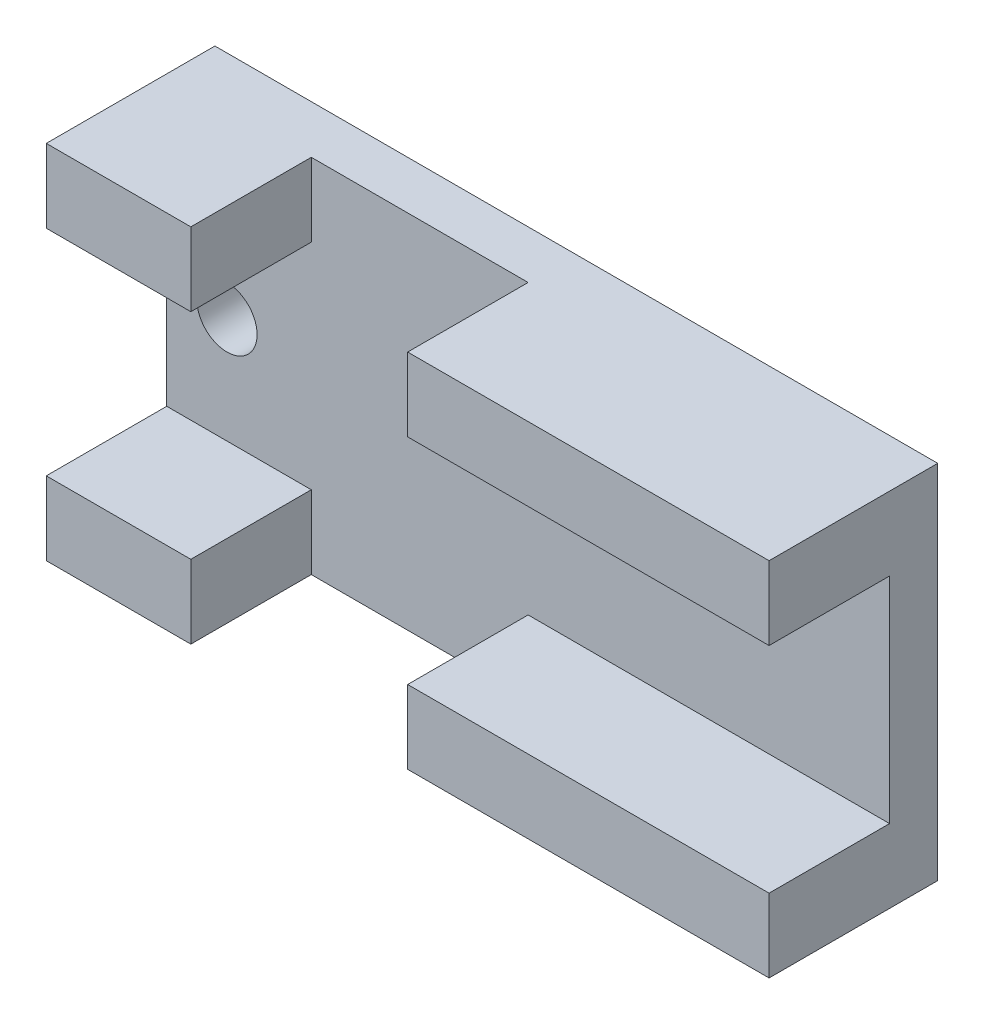
ISO-10303-21;
HEADER;
FILE_DESCRIPTION(('STEP AP214'),'2;1');
FILE_NAME('part.step','',(''),(''),'','','');
FILE_SCHEMA(('AUTOMOTIVE_DESIGN { 1 0 10303 214 1 1 1 1 }'));
ENDSEC;
DATA;
#1=APPLICATION_CONTEXT('core data for automotive mechanical design processes');
#2=APPLICATION_PROTOCOL_DEFINITION('international standard','automotive_design',2000,#1);
#3=PRODUCT_CONTEXT('',#1,'mechanical');
#4=PRODUCT('Part','Part','',(#3));
#5=PRODUCT_RELATED_PRODUCT_CATEGORY('part','',(#4));
#6=PRODUCT_DEFINITION_FORMATION('','',#4);
#7=PRODUCT_DEFINITION_CONTEXT('part definition',#1,'design');
#8=PRODUCT_DEFINITION('design','',#6,#7);
#9=PRODUCT_DEFINITION_SHAPE('','',#8);
#10=(LENGTH_UNIT() NAMED_UNIT(*) SI_UNIT(.MILLI.,.METRE.));
#11=(NAMED_UNIT(*) PLANE_ANGLE_UNIT() SI_UNIT($,.RADIAN.));
#12=(NAMED_UNIT(*) SI_UNIT($,.STERADIAN.) SOLID_ANGLE_UNIT());
#13=UNCERTAINTY_MEASURE_WITH_UNIT(LENGTH_MEASURE(1.E-05),#10,'distance_accuracy_value','');
#14=(GEOMETRIC_REPRESENTATION_CONTEXT(3) GLOBAL_UNCERTAINTY_ASSIGNED_CONTEXT((#13)) GLOBAL_UNIT_ASSIGNED_CONTEXT((#10,
#11,#12)) REPRESENTATION_CONTEXT('',''));
#15=CARTESIAN_POINT('',(0.,0.,0.));
#16=DIRECTION('',(0.,0.,1.));
#17=DIRECTION('',(1.,0.,0.));
#18=AXIS2_PLACEMENT_3D('',#15,#16,#17);
#19=CARTESIAN_POINT('',(0.,0.,5.08));
#20=DIRECTION('',(0.,0.,-1.));
#21=DIRECTION('',(-1.,0.,0.));
#22=AXIS2_PLACEMENT_3D('',#19,#20,#21);
#23=PLANE('',#22);
#24=CARTESIAN_POINT('',(-31.75,0.,5.08));
#25=DIRECTION('',(0.,0.,1.));
#26=DIRECTION('',(1.,0.,0.));
#27=AXIS2_PLACEMENT_3D('',#24,#25,#26);
#28=CIRCLE('',#27,3.175);
#29=CARTESIAN_POINT('',(-28.575,0.,5.08));
#30=VERTEX_POINT('',#29);
#31=EDGE_CURVE('E449',#30,#30,#28,.T.);
#32=ORIENTED_EDGE('',*,*,#31,.F.);
#33=EDGE_LOOP('',(#32));
#34=FACE_BOUND('',#33,.T.);
#35=CARTESIAN_POINT('',(25.4,6.35,5.08));
#36=DIRECTION('',(0.,0.,1.));
#37=DIRECTION('',(1.,0.,0.));
#38=AXIS2_PLACEMENT_3D('',#35,#36,#37);
#39=CIRCLE('',#38,3.175);
#40=CARTESIAN_POINT('',(28.575,6.35,5.08));
#41=VERTEX_POINT('',#40);
#42=EDGE_CURVE('E186',#41,#41,#39,.T.);
#43=ORIENTED_EDGE('',*,*,#42,.F.);
#44=EDGE_LOOP('',(#43));
#45=FACE_BOUND('',#44,.T.);
#46=DIRECTION('',(1.,0.,0.));
#47=VECTOR('',#46,1.);
#48=CARTESIAN_POINT('',(-38.1,11.303,5.08));
#49=LINE('',#48,#47);
#50=CARTESIAN_POINT('',(-38.1,11.303,5.08));
#51=VERTEX_POINT('',#50);
#52=CARTESIAN_POINT('',(-22.86,11.303,5.08));
#53=VERTEX_POINT('',#52);
#54=EDGE_CURVE('E167',#51,#53,#49,.T.);
#55=ORIENTED_EDGE('',*,*,#54,.F.);
#56=DIRECTION('',(0.,-1.,0.));
#57=VECTOR('',#56,1.);
#58=CARTESIAN_POINT('',(-38.1,-19.05,5.08));
#59=LINE('',#58,#57);
#60=CARTESIAN_POINT('',(-38.1,-11.303,5.08));
#61=VERTEX_POINT('',#60);
#62=EDGE_CURVE('E155',#51,#61,#59,.T.);
#63=ORIENTED_EDGE('',*,*,#62,.T.);
#64=DIRECTION('',(-1.,0.,0.));
#65=VECTOR('',#64,1.);
#66=CARTESIAN_POINT('',(-38.1,-11.303,5.08));
#67=LINE('',#66,#65);
#68=CARTESIAN_POINT('',(-22.86,-11.303,5.08));
#69=VERTEX_POINT('',#68);
#70=EDGE_CURVE('E217',#69,#61,#67,.T.);
#71=ORIENTED_EDGE('',*,*,#70,.F.);
#72=DIRECTION('',(0.,1.,0.));
#73=VECTOR('',#72,1.);
#74=CARTESIAN_POINT('',(-22.86,-19.05,5.08));
#75=LINE('',#74,#73);
#76=CARTESIAN_POINT('',(-22.86,-19.05,5.08));
#77=VERTEX_POINT('',#76);
#78=EDGE_CURVE('E220',#77,#69,#75,.T.);
#79=ORIENTED_EDGE('',*,*,#78,.F.);
#80=DIRECTION('',(1.,0.,0.));
#81=VECTOR('',#80,1.);
#82=CARTESIAN_POINT('',(-38.1,-19.05,5.08));
#83=LINE('',#82,#81);
#84=CARTESIAN_POINT('',(0.,-19.05,5.08));
#85=VERTEX_POINT('',#84);
#86=EDGE_CURVE('E165',#77,#85,#83,.T.);
#87=ORIENTED_EDGE('',*,*,#86,.T.);
#88=DIRECTION('',(0.,-1.,0.));
#89=VECTOR('',#88,1.);
#90=CARTESIAN_POINT('',(0.,-19.05,5.08));
#91=LINE('',#90,#89);
#92=CARTESIAN_POINT('',(0.,-11.303,5.08));
#93=VERTEX_POINT('',#92);
#94=EDGE_CURVE('E253',#93,#85,#91,.T.);
#95=ORIENTED_EDGE('',*,*,#94,.F.);
#96=DIRECTION('',(-1.,0.,0.));
#97=VECTOR('',#96,1.);
#98=CARTESIAN_POINT('',(0.,-11.303,5.08));
#99=LINE('',#98,#97);
#100=CARTESIAN_POINT('',(38.1,-11.303,5.08));
#101=VERTEX_POINT('',#100);
#102=EDGE_CURVE('E249',#101,#93,#99,.T.);
#103=ORIENTED_EDGE('',*,*,#102,.F.);
#104=DIRECTION('',(0.,1.,0.));
#105=VECTOR('',#104,1.);
#106=CARTESIAN_POINT('',(38.1,-19.05,5.08));
#107=LINE('',#106,#105);
#108=CARTESIAN_POINT('',(38.1,11.303,5.08));
#109=VERTEX_POINT('',#108);
#110=EDGE_CURVE('E305',#101,#109,#107,.T.);
#111=ORIENTED_EDGE('',*,*,#110,.T.);
#112=DIRECTION('',(1.,0.,0.));
#113=VECTOR('',#112,1.);
#114=CARTESIAN_POINT('',(0.,11.303,5.08));
#115=LINE('',#114,#113);
#116=CARTESIAN_POINT('',(0.,11.303,5.08));
#117=VERTEX_POINT('',#116);
#118=EDGE_CURVE('E276',#117,#109,#115,.T.);
#119=ORIENTED_EDGE('',*,*,#118,.F.);
#120=DIRECTION('',(0.,-1.,0.));
#121=VECTOR('',#120,1.);
#122=CARTESIAN_POINT('',(0.,19.05,5.08));
#123=LINE('',#122,#121);
#124=CARTESIAN_POINT('',(0.,19.05,5.08));
#125=VERTEX_POINT('',#124);
#126=EDGE_CURVE('E258',#125,#117,#123,.T.);
#127=ORIENTED_EDGE('',*,*,#126,.F.);
#128=DIRECTION('',(-1.,0.,0.));
#129=VECTOR('',#128,1.);
#130=CARTESIAN_POINT('',(-38.1,19.05,5.08));
#131=LINE('',#130,#129);
#132=CARTESIAN_POINT('',(-22.86,19.05,5.08));
#133=VERTEX_POINT('',#132);
#134=EDGE_CURVE('E63',#125,#133,#131,.T.);
#135=ORIENTED_EDGE('',*,*,#134,.T.);
#136=DIRECTION('',(0.,1.,0.));
#137=VECTOR('',#136,1.);
#138=CARTESIAN_POINT('',(-22.86,19.05,5.08));
#139=LINE('',#138,#137);
#140=EDGE_CURVE('E58',#53,#133,#139,.T.);
#141=ORIENTED_EDGE('',*,*,#140,.F.);
#142=EDGE_LOOP('',(#55,#63,#71,#79,#87,#95,#103,#111,#119,#127,#135,#141));
#143=FACE_BOUND('',#142,.T.);
#144=ADVANCED_FACE('F42',(#34,#45,#143),#23,.F.);
#145=CARTESIAN_POINT('',(38.1,-19.05,5.08));
#146=DIRECTION('',(-1.,0.,0.));
#147=DIRECTION('',(0.,0.,1.));
#148=AXIS2_PLACEMENT_3D('',#145,#146,#147);
#149=PLANE('',#148);
#150=DIRECTION('',(0.,1.,0.));
#151=VECTOR('',#150,1.);
#152=CARTESIAN_POINT('',(38.1,-19.05,0.));
#153=LINE('',#152,#151);
#154=CARTESIAN_POINT('',(38.1,-19.05,0.));
#155=VERTEX_POINT('',#154);
#156=CARTESIAN_POINT('',(38.1,19.05,0.));
#157=VERTEX_POINT('',#156);
#158=EDGE_CURVE('E304',#155,#157,#153,.T.);
#159=ORIENTED_EDGE('',*,*,#158,.T.);
#160=DIRECTION('',(0.,0.,-1.));
#161=VECTOR('',#160,1.);
#162=CARTESIAN_POINT('',(38.1,19.05,5.08));
#163=LINE('',#162,#161);
#164=CARTESIAN_POINT('',(38.1,19.05,17.78));
#165=VERTEX_POINT('',#164);
#166=EDGE_CURVE('E11',#165,#157,#163,.T.);
#167=ORIENTED_EDGE('',*,*,#166,.F.);
#168=DIRECTION('',(0.,1.,0.));
#169=VECTOR('',#168,1.);
#170=CARTESIAN_POINT('',(38.1,19.05,17.78));
#171=LINE('',#170,#169);
#172=CARTESIAN_POINT('',(38.1,11.303,17.78));
#173=VERTEX_POINT('',#172);
#174=EDGE_CURVE('E279',#173,#165,#171,.T.);
#175=ORIENTED_EDGE('',*,*,#174,.F.);
#176=DIRECTION('',(0.,0.,-1.));
#177=VECTOR('',#176,1.);
#178=CARTESIAN_POINT('',(38.1,11.303,17.78));
#179=LINE('',#178,#177);
#180=EDGE_CURVE('E296',#173,#109,#179,.T.);
#181=ORIENTED_EDGE('',*,*,#180,.T.);
#182=ORIENTED_EDGE('',*,*,#110,.F.);
#183=DIRECTION('',(0.,0.,-1.));
#184=VECTOR('',#183,1.);
#185=CARTESIAN_POINT('',(38.1,-11.303,17.78));
#186=LINE('',#185,#184);
#187=CARTESIAN_POINT('',(38.1,-11.303,17.78));
#188=VERTEX_POINT('',#187);
#189=EDGE_CURVE('E240',#188,#101,#186,.T.);
#190=ORIENTED_EDGE('',*,*,#189,.F.);
#191=DIRECTION('',(0.,1.,0.));
#192=VECTOR('',#191,1.);
#193=CARTESIAN_POINT('',(38.1,-19.05,17.78));
#194=LINE('',#193,#192);
#195=CARTESIAN_POINT('',(38.1,-19.05,17.78));
#196=VERTEX_POINT('',#195);
#197=EDGE_CURVE('E261',#196,#188,#194,.T.);
#198=ORIENTED_EDGE('',*,*,#197,.F.);
#199=DIRECTION('',(0.,0.,-1.));
#200=VECTOR('',#199,1.);
#201=CARTESIAN_POINT('',(38.1,-19.05,5.08));
#202=LINE('',#201,#200);
#203=EDGE_CURVE('E313',#196,#155,#202,.T.);
#204=ORIENTED_EDGE('',*,*,#203,.T.);
#205=EDGE_LOOP('',(#159,#167,#175,#181,#182,#190,#198,#204));
#206=FACE_BOUND('',#205,.T.);
#207=ADVANCED_FACE('F44',(#206),#149,.F.);
#208=CARTESIAN_POINT('',(-38.1,19.05,5.08));
#209=DIRECTION('',(0.,-1.,0.));
#210=DIRECTION('',(0.,0.,-1.));
#211=AXIS2_PLACEMENT_3D('',#208,#209,#210);
#212=PLANE('',#211);
#213=DIRECTION('',(-1.,0.,0.));
#214=VECTOR('',#213,1.);
#215=CARTESIAN_POINT('',(-38.1,19.05,0.));
#216=LINE('',#215,#214);
#217=CARTESIAN_POINT('',(-38.1,19.05,0.));
#218=VERTEX_POINT('',#217);
#219=EDGE_CURVE('E317',#157,#218,#216,.T.);
#220=ORIENTED_EDGE('',*,*,#219,.T.);
#221=DIRECTION('',(0.,0.,-1.));
#222=VECTOR('',#221,1.);
#223=CARTESIAN_POINT('',(-38.1,19.05,5.08));
#224=LINE('',#223,#222);
#225=CARTESIAN_POINT('',(-38.1,19.05,17.78));
#226=VERTEX_POINT('',#225);
#227=EDGE_CURVE('E51',#226,#218,#224,.T.);
#228=ORIENTED_EDGE('',*,*,#227,.F.);
#229=DIRECTION('',(-1.,0.,0.));
#230=VECTOR('',#229,1.);
#231=CARTESIAN_POINT('',(-38.1,19.05,17.78));
#232=LINE('',#231,#230);
#233=CARTESIAN_POINT('',(-22.86,19.05,17.78));
#234=VERTEX_POINT('',#233);
#235=EDGE_CURVE('E193',#234,#226,#232,.T.);
#236=ORIENTED_EDGE('',*,*,#235,.F.);
#237=DIRECTION('',(0.,0.,-1.));
#238=VECTOR('',#237,1.);
#239=CARTESIAN_POINT('',(-22.86,19.05,17.78));
#240=LINE('',#239,#238);
#241=EDGE_CURVE('E183',#234,#133,#240,.T.);
#242=ORIENTED_EDGE('',*,*,#241,.T.);
#243=ORIENTED_EDGE('',*,*,#134,.F.);
#244=DIRECTION('',(0.,0.,-1.));
#245=VECTOR('',#244,1.);
#246=CARTESIAN_POINT('',(0.,19.05,17.78));
#247=LINE('',#246,#245);
#248=CARTESIAN_POINT('',(0.,19.05,17.78));
#249=VERTEX_POINT('',#248);
#250=EDGE_CURVE('E286',#249,#125,#247,.T.);
#251=ORIENTED_EDGE('',*,*,#250,.F.);
#252=DIRECTION('',(-1.,0.,0.));
#253=VECTOR('',#252,1.);
#254=CARTESIAN_POINT('',(0.,19.05,17.78));
#255=LINE('',#254,#253);
#256=EDGE_CURVE('E283',#165,#249,#255,.T.);
#257=ORIENTED_EDGE('',*,*,#256,.F.);
#258=ORIENTED_EDGE('',*,*,#166,.T.);
#259=EDGE_LOOP('',(#220,#228,#236,#242,#243,#251,#257,#258));
#260=FACE_BOUND('',#259,.T.);
#261=ADVANCED_FACE('F377',(#260),#212,.F.);
#262=CARTESIAN_POINT('',(-38.1,-19.05,5.08));
#263=DIRECTION('',(1.,0.,0.));
#264=DIRECTION('',(0.,0.,-1.));
#265=AXIS2_PLACEMENT_3D('',#262,#263,#264);
#266=PLANE('',#265);
#267=DIRECTION('',(0.,-1.,0.));
#268=VECTOR('',#267,1.);
#269=CARTESIAN_POINT('',(-38.1,-19.05,0.));
#270=LINE('',#269,#268);
#271=CARTESIAN_POINT('',(-38.1,-19.05,0.));
#272=VERTEX_POINT('',#271);
#273=EDGE_CURVE('E320',#218,#272,#270,.T.);
#274=ORIENTED_EDGE('',*,*,#273,.T.);
#275=DIRECTION('',(0.,0.,-1.));
#276=VECTOR('',#275,1.);
#277=CARTESIAN_POINT('',(-38.1,-19.05,5.08));
#278=LINE('',#277,#276);
#279=CARTESIAN_POINT('',(-38.1,-19.05,17.78));
#280=VERTEX_POINT('',#279);
#281=EDGE_CURVE('E328',#280,#272,#278,.T.);
#282=ORIENTED_EDGE('',*,*,#281,.F.);
#283=DIRECTION('',(0.,-1.,0.));
#284=VECTOR('',#283,1.);
#285=CARTESIAN_POINT('',(-38.1,-19.05,17.78));
#286=LINE('',#285,#284);
#287=CARTESIAN_POINT('',(-38.1,-11.303,17.78));
#288=VERTEX_POINT('',#287);
#289=EDGE_CURVE('E221',#288,#280,#286,.T.);
#290=ORIENTED_EDGE('',*,*,#289,.F.);
#291=DIRECTION('',(0.,0.,-1.));
#292=VECTOR('',#291,1.);
#293=CARTESIAN_POINT('',(-38.1,-11.303,17.78));
#294=LINE('',#293,#292);
#295=EDGE_CURVE('E162',#288,#61,#294,.T.);
#296=ORIENTED_EDGE('',*,*,#295,.T.);
#297=ORIENTED_EDGE('',*,*,#62,.F.);
#298=DIRECTION('',(0.,0.,-1.));
#299=VECTOR('',#298,1.);
#300=CARTESIAN_POINT('',(-38.1,11.303,17.78));
#301=LINE('',#300,#299);
#302=CARTESIAN_POINT('',(-38.1,11.303,17.78));
#303=VERTEX_POINT('',#302);
#304=EDGE_CURVE('E159',#303,#51,#301,.T.);
#305=ORIENTED_EDGE('',*,*,#304,.F.);
#306=DIRECTION('',(0.,-1.,0.));
#307=VECTOR('',#306,1.);
#308=CARTESIAN_POINT('',(-38.1,19.05,17.78));
#309=LINE('',#308,#307);
#310=EDGE_CURVE('E195',#226,#303,#309,.T.);
#311=ORIENTED_EDGE('',*,*,#310,.F.);
#312=ORIENTED_EDGE('',*,*,#227,.T.);
#313=EDGE_LOOP('',(#274,#282,#290,#296,#297,#305,#311,#312));
#314=FACE_BOUND('',#313,.T.);
#315=ADVANCED_FACE('F156',(#314),#266,.F.);
#316=CARTESIAN_POINT('',(-38.1,-19.05,5.08));
#317=DIRECTION('',(0.,1.,0.));
#318=DIRECTION('',(0.,0.,1.));
#319=AXIS2_PLACEMENT_3D('',#316,#317,#318);
#320=PLANE('',#319);
#321=DIRECTION('',(1.,0.,0.));
#322=VECTOR('',#321,1.);
#323=CARTESIAN_POINT('',(-38.1,-19.05,0.));
#324=LINE('',#323,#322);
#325=EDGE_CURVE('E308',#272,#155,#324,.T.);
#326=ORIENTED_EDGE('',*,*,#325,.T.);
#327=ORIENTED_EDGE('',*,*,#203,.F.);
#328=DIRECTION('',(1.,0.,0.));
#329=VECTOR('',#328,1.);
#330=CARTESIAN_POINT('',(0.,-19.05,17.78));
#331=LINE('',#330,#329);
#332=CARTESIAN_POINT('',(0.,-19.05,17.78));
#333=VERTEX_POINT('',#332);
#334=EDGE_CURVE('E264',#333,#196,#331,.T.);
#335=ORIENTED_EDGE('',*,*,#334,.F.);
#336=DIRECTION('',(0.,0.,-1.));
#337=VECTOR('',#336,1.);
#338=CARTESIAN_POINT('',(0.,-19.05,17.78));
#339=LINE('',#338,#337);
#340=EDGE_CURVE('E225',#333,#85,#339,.T.);
#341=ORIENTED_EDGE('',*,*,#340,.T.);
#342=ORIENTED_EDGE('',*,*,#86,.F.);
#343=DIRECTION('',(0.,0.,-1.));
#344=VECTOR('',#343,1.);
#345=CARTESIAN_POINT('',(-22.86,-19.05,17.78));
#346=LINE('',#345,#344);
#347=CARTESIAN_POINT('',(-22.86,-19.05,17.78));
#348=VERTEX_POINT('',#347);
#349=EDGE_CURVE('E172',#348,#77,#346,.T.);
#350=ORIENTED_EDGE('',*,*,#349,.F.);
#351=DIRECTION('',(1.,0.,0.));
#352=VECTOR('',#351,1.);
#353=CARTESIAN_POINT('',(-38.1,-19.05,17.78));
#354=LINE('',#353,#352);
#355=EDGE_CURVE('E231',#280,#348,#354,.T.);
#356=ORIENTED_EDGE('',*,*,#355,.F.);
#357=ORIENTED_EDGE('',*,*,#281,.T.);
#358=EDGE_LOOP('',(#326,#327,#335,#341,#342,#350,#356,#357));
#359=FACE_BOUND('',#358,.T.);
#360=ADVANCED_FACE('F341',(#359),#320,.F.);
#361=CARTESIAN_POINT('',(0.,0.,0.));
#362=DIRECTION('',(0.,0.,-1.));
#363=DIRECTION('',(-1.,0.,0.));
#364=AXIS2_PLACEMENT_3D('',#361,#362,#363);
#365=PLANE('',#364);
#366=CARTESIAN_POINT('',(-31.75,0.,0.));
#367=DIRECTION('',(0.,0.,1.));
#368=DIRECTION('',(1.,0.,0.));
#369=AXIS2_PLACEMENT_3D('',#366,#367,#368);
#370=CIRCLE('',#369,3.175);
#371=CARTESIAN_POINT('',(-28.575,0.,0.));
#372=VERTEX_POINT('',#371);
#373=EDGE_CURVE('E447',#372,#372,#370,.T.);
#374=ORIENTED_EDGE('',*,*,#373,.T.);
#375=EDGE_LOOP('',(#374));
#376=FACE_BOUND('',#375,.T.);
#377=CARTESIAN_POINT('',(25.4,6.35,0.));
#378=DIRECTION('',(0.,0.,1.));
#379=DIRECTION('',(1.,0.,0.));
#380=AXIS2_PLACEMENT_3D('',#377,#378,#379);
#381=CIRCLE('',#380,3.175);
#382=CARTESIAN_POINT('',(28.575,6.35,0.));
#383=VERTEX_POINT('',#382);
#384=EDGE_CURVE('E179',#383,#383,#381,.T.);
#385=ORIENTED_EDGE('',*,*,#384,.T.);
#386=EDGE_LOOP('',(#385));
#387=FACE_BOUND('',#386,.T.);
#388=ORIENTED_EDGE('',*,*,#158,.F.);
#389=ORIENTED_EDGE('',*,*,#325,.F.);
#390=ORIENTED_EDGE('',*,*,#273,.F.);
#391=ORIENTED_EDGE('',*,*,#219,.F.);
#392=EDGE_LOOP('',(#388,#389,#390,#391));
#393=FACE_BOUND('',#392,.T.);
#394=ADVANCED_FACE('F339',(#376,#387,#393),#365,.T.);
#395=CARTESIAN_POINT('',(0.,19.05,17.78));
#396=DIRECTION('',(1.,0.,0.));
#397=DIRECTION('',(0.,0.,-1.));
#398=AXIS2_PLACEMENT_3D('',#395,#396,#397);
#399=PLANE('',#398);
#400=ORIENTED_EDGE('',*,*,#126,.T.);
#401=DIRECTION('',(0.,0.,-1.));
#402=VECTOR('',#401,1.);
#403=CARTESIAN_POINT('',(0.,11.303,17.78));
#404=LINE('',#403,#402);
#405=CARTESIAN_POINT('',(0.,11.303,17.78));
#406=VERTEX_POINT('',#405);
#407=EDGE_CURVE('E300',#406,#117,#404,.T.);
#408=ORIENTED_EDGE('',*,*,#407,.F.);
#409=DIRECTION('',(0.,-1.,0.));
#410=VECTOR('',#409,1.);
#411=CARTESIAN_POINT('',(0.,19.05,17.78));
#412=LINE('',#411,#410);
#413=EDGE_CURVE('E271',#249,#406,#412,.T.);
#414=ORIENTED_EDGE('',*,*,#413,.F.);
#415=ORIENTED_EDGE('',*,*,#250,.T.);
#416=EDGE_LOOP('',(#400,#408,#414,#415));
#417=FACE_BOUND('',#416,.T.);
#418=ADVANCED_FACE('F382',(#417),#399,.F.);
#419=CARTESIAN_POINT('',(0.,11.303,17.78));
#420=DIRECTION('',(0.,1.,0.));
#421=DIRECTION('',(0.,0.,1.));
#422=AXIS2_PLACEMENT_3D('',#419,#420,#421);
#423=PLANE('',#422);
#424=ORIENTED_EDGE('',*,*,#118,.T.);
#425=ORIENTED_EDGE('',*,*,#180,.F.);
#426=DIRECTION('',(1.,0.,0.));
#427=VECTOR('',#426,1.);
#428=CARTESIAN_POINT('',(0.,11.303,17.78));
#429=LINE('',#428,#427);
#430=EDGE_CURVE('E275',#406,#173,#429,.T.);
#431=ORIENTED_EDGE('',*,*,#430,.F.);
#432=ORIENTED_EDGE('',*,*,#407,.T.);
#433=EDGE_LOOP('',(#424,#425,#431,#432));
#434=FACE_BOUND('',#433,.T.);
#435=ADVANCED_FACE('F400',(#434),#423,.F.);
#436=CARTESIAN_POINT('',(0.,0.,17.78));
#437=DIRECTION('',(0.,0.,1.));
#438=DIRECTION('',(1.,0.,0.));
#439=AXIS2_PLACEMENT_3D('',#436,#437,#438);
#440=PLANE('',#439);
#441=ORIENTED_EDGE('',*,*,#413,.T.);
#442=ORIENTED_EDGE('',*,*,#430,.T.);
#443=ORIENTED_EDGE('',*,*,#174,.T.);
#444=ORIENTED_EDGE('',*,*,#256,.T.);
#445=EDGE_LOOP('',(#441,#442,#443,#444));
#446=FACE_BOUND('',#445,.T.);
#447=ADVANCED_FACE('F367',(#446),#440,.T.);
#448=CARTESIAN_POINT('',(0.,-19.05,17.78));
#449=DIRECTION('',(1.,0.,0.));
#450=DIRECTION('',(0.,0.,-1.));
#451=AXIS2_PLACEMENT_3D('',#448,#449,#450);
#452=PLANE('',#451);
#453=ORIENTED_EDGE('',*,*,#94,.T.);
#454=ORIENTED_EDGE('',*,*,#340,.F.);
#455=DIRECTION('',(0.,-1.,0.));
#456=VECTOR('',#455,1.);
#457=CARTESIAN_POINT('',(0.,-19.05,17.78));
#458=LINE('',#457,#456);
#459=CARTESIAN_POINT('',(0.,-11.303,17.78));
#460=VERTEX_POINT('',#459);
#461=EDGE_CURVE('E254',#460,#333,#458,.T.);
#462=ORIENTED_EDGE('',*,*,#461,.F.);
#463=DIRECTION('',(0.,0.,-1.));
#464=VECTOR('',#463,1.);
#465=CARTESIAN_POINT('',(0.,-11.303,17.78));
#466=LINE('',#465,#464);
#467=EDGE_CURVE('E244',#460,#93,#466,.T.);
#468=ORIENTED_EDGE('',*,*,#467,.T.);
#469=EDGE_LOOP('',(#453,#454,#462,#468));
#470=FACE_BOUND('',#469,.T.);
#471=ADVANCED_FACE('F356',(#470),#452,.F.);
#472=CARTESIAN_POINT('',(0.,-11.303,17.78));
#473=DIRECTION('',(0.,-1.,0.));
#474=DIRECTION('',(0.,0.,-1.));
#475=AXIS2_PLACEMENT_3D('',#472,#473,#474);
#476=PLANE('',#475);
#477=ORIENTED_EDGE('',*,*,#102,.T.);
#478=ORIENTED_EDGE('',*,*,#467,.F.);
#479=DIRECTION('',(-1.,0.,0.));
#480=VECTOR('',#479,1.);
#481=CARTESIAN_POINT('',(0.,-11.303,17.78));
#482=LINE('',#481,#480);
#483=EDGE_CURVE('E248',#188,#460,#482,.T.);
#484=ORIENTED_EDGE('',*,*,#483,.F.);
#485=ORIENTED_EDGE('',*,*,#189,.T.);
#486=EDGE_LOOP('',(#477,#478,#484,#485));
#487=FACE_BOUND('',#486,.T.);
#488=ADVANCED_FACE('F358',(#487),#476,.F.);
#489=CARTESIAN_POINT('',(0.,0.,17.78));
#490=DIRECTION('',(0.,0.,-1.));
#491=DIRECTION('',(-1.,0.,0.));
#492=AXIS2_PLACEMENT_3D('',#489,#490,#491);
#493=PLANE('',#492);
#494=ORIENTED_EDGE('',*,*,#461,.T.);
#495=ORIENTED_EDGE('',*,*,#334,.T.);
#496=ORIENTED_EDGE('',*,*,#197,.T.);
#497=ORIENTED_EDGE('',*,*,#483,.T.);
#498=EDGE_LOOP('',(#494,#495,#496,#497));
#499=FACE_BOUND('',#498,.T.);
#500=ADVANCED_FACE('F349',(#499),#493,.F.);
#501=CARTESIAN_POINT('',(-22.86,-19.05,17.78));
#502=DIRECTION('',(-1.,0.,0.));
#503=DIRECTION('',(0.,0.,1.));
#504=AXIS2_PLACEMENT_3D('',#501,#502,#503);
#505=PLANE('',#504);
#506=ORIENTED_EDGE('',*,*,#78,.T.);
#507=DIRECTION('',(0.,0.,-1.));
#508=VECTOR('',#507,1.);
#509=CARTESIAN_POINT('',(-22.86,-11.303,17.78));
#510=LINE('',#509,#508);
#511=CARTESIAN_POINT('',(-22.86,-11.303,17.78));
#512=VERTEX_POINT('',#511);
#513=EDGE_CURVE('E210',#512,#69,#510,.T.);
#514=ORIENTED_EDGE('',*,*,#513,.F.);
#515=DIRECTION('',(0.,1.,0.));
#516=VECTOR('',#515,1.);
#517=CARTESIAN_POINT('',(-22.86,-19.05,17.78));
#518=LINE('',#517,#516);
#519=EDGE_CURVE('E228',#348,#512,#518,.T.);
#520=ORIENTED_EDGE('',*,*,#519,.F.);
#521=ORIENTED_EDGE('',*,*,#349,.T.);
#522=EDGE_LOOP('',(#506,#514,#520,#521));
#523=FACE_BOUND('',#522,.T.);
#524=ADVANCED_FACE('F365',(#523),#505,.F.);
#525=CARTESIAN_POINT('',(-38.1,-11.303,17.78));
#526=DIRECTION('',(0.,-1.,0.));
#527=DIRECTION('',(0.,0.,-1.));
#528=AXIS2_PLACEMENT_3D('',#525,#526,#527);
#529=PLANE('',#528);
#530=ORIENTED_EDGE('',*,*,#70,.T.);
#531=ORIENTED_EDGE('',*,*,#295,.F.);
#532=DIRECTION('',(-1.,0.,0.));
#533=VECTOR('',#532,1.);
#534=CARTESIAN_POINT('',(-38.1,-11.303,17.78));
#535=LINE('',#534,#533);
#536=EDGE_CURVE('E216',#512,#288,#535,.T.);
#537=ORIENTED_EDGE('',*,*,#536,.F.);
#538=ORIENTED_EDGE('',*,*,#513,.T.);
#539=EDGE_LOOP('',(#530,#531,#537,#538));
#540=FACE_BOUND('',#539,.T.);
#541=ADVANCED_FACE('F423',(#540),#529,.F.);
#542=CARTESIAN_POINT('',(0.,0.,17.78));
#543=DIRECTION('',(0.,0.,-1.));
#544=DIRECTION('',(-1.,0.,0.));
#545=AXIS2_PLACEMENT_3D('',#542,#543,#544);
#546=PLANE('',#545);
#547=ORIENTED_EDGE('',*,*,#289,.T.);
#548=ORIENTED_EDGE('',*,*,#355,.T.);
#549=ORIENTED_EDGE('',*,*,#519,.T.);
#550=ORIENTED_EDGE('',*,*,#536,.T.);
#551=EDGE_LOOP('',(#547,#548,#549,#550));
#552=FACE_BOUND('',#551,.T.);
#553=ADVANCED_FACE('F427',(#552),#546,.F.);
#554=CARTESIAN_POINT('',(-38.1,11.303,17.78));
#555=DIRECTION('',(0.,1.,0.));
#556=DIRECTION('',(0.,0.,1.));
#557=AXIS2_PLACEMENT_3D('',#554,#555,#556);
#558=PLANE('',#557);
#559=ORIENTED_EDGE('',*,*,#54,.T.);
#560=DIRECTION('',(0.,0.,-1.));
#561=VECTOR('',#560,1.);
#562=CARTESIAN_POINT('',(-22.86,11.303,17.78));
#563=LINE('',#562,#561);
#564=CARTESIAN_POINT('',(-22.86,11.303,17.78));
#565=VERTEX_POINT('',#564);
#566=EDGE_CURVE('E178',#565,#53,#563,.T.);
#567=ORIENTED_EDGE('',*,*,#566,.F.);
#568=DIRECTION('',(1.,0.,0.));
#569=VECTOR('',#568,1.);
#570=CARTESIAN_POINT('',(-38.1,11.303,17.78));
#571=LINE('',#570,#569);
#572=EDGE_CURVE('E175',#303,#565,#571,.T.);
#573=ORIENTED_EDGE('',*,*,#572,.F.);
#574=ORIENTED_EDGE('',*,*,#304,.T.);
#575=EDGE_LOOP('',(#559,#567,#573,#574));
#576=FACE_BOUND('',#575,.T.);
#577=ADVANCED_FACE('F174',(#576),#558,.F.);
#578=CARTESIAN_POINT('',(-22.86,19.05,17.78));
#579=DIRECTION('',(-1.,0.,0.));
#580=DIRECTION('',(0.,-1.,0.));
#581=AXIS2_PLACEMENT_3D('',#578,#579,#580);
#582=PLANE('',#581);
#583=ORIENTED_EDGE('',*,*,#140,.T.);
#584=ORIENTED_EDGE('',*,*,#241,.F.);
#585=DIRECTION('',(0.,1.,0.));
#586=VECTOR('',#585,1.);
#587=CARTESIAN_POINT('',(-22.86,19.05,17.78));
#588=LINE('',#587,#586);
#589=EDGE_CURVE('E200',#565,#234,#588,.T.);
#590=ORIENTED_EDGE('',*,*,#589,.F.);
#591=ORIENTED_EDGE('',*,*,#566,.T.);
#592=EDGE_LOOP('',(#583,#584,#590,#591));
#593=FACE_BOUND('',#592,.T.);
#594=ADVANCED_FACE('F405',(#593),#582,.F.);
#595=CARTESIAN_POINT('',(0.,0.,17.78));
#596=DIRECTION('',(0.,0.,1.));
#597=DIRECTION('',(1.,0.,0.));
#598=AXIS2_PLACEMENT_3D('',#595,#596,#597);
#599=PLANE('',#598);
#600=ORIENTED_EDGE('',*,*,#310,.T.);
#601=ORIENTED_EDGE('',*,*,#572,.T.);
#602=ORIENTED_EDGE('',*,*,#589,.T.);
#603=ORIENTED_EDGE('',*,*,#235,.T.);
#604=EDGE_LOOP('',(#600,#601,#602,#603));
#605=FACE_BOUND('',#604,.T.);
#606=ADVANCED_FACE('F407',(#605),#599,.T.);
#607=CARTESIAN_POINT('',(25.4,6.35,0.));
#608=DIRECTION('',(0.,0.,1.));
#609=DIRECTION('',(1.,0.,0.));
#610=AXIS2_PLACEMENT_3D('',#607,#608,#609);
#611=CYLINDRICAL_SURFACE('',#610,3.175);
#612=ORIENTED_EDGE('',*,*,#384,.F.);
#613=EDGE_LOOP('',(#612));
#614=FACE_BOUND('',#613,.T.);
#615=ORIENTED_EDGE('',*,*,#42,.T.);
#616=EDGE_LOOP('',(#615));
#617=FACE_BOUND('',#616,.T.);
#618=ADVANCED_FACE('F409',(#614,#617),#611,.F.);
#619=CARTESIAN_POINT('',(-31.75,0.,0.));
#620=DIRECTION('',(0.,0.,1.));
#621=DIRECTION('',(1.,0.,0.));
#622=AXIS2_PLACEMENT_3D('',#619,#620,#621);
#623=CYLINDRICAL_SURFACE('',#622,3.175);
#624=ORIENTED_EDGE('',*,*,#373,.F.);
#625=EDGE_LOOP('',(#624));
#626=FACE_BOUND('',#625,.T.);
#627=ORIENTED_EDGE('',*,*,#31,.T.);
#628=EDGE_LOOP('',(#627));
#629=FACE_BOUND('',#628,.T.);
#630=ADVANCED_FACE('F415',(#626,#629),#623,.F.);
#631=CLOSED_SHELL('',(#144,#207,#261,#315,#360,#394,#418,#435,#447,#471,#488,#500,#524,#541,
#553,#577,#594,#606,#618,#630));
#632=MANIFOLD_SOLID_BREP('B2',#631);
#633=ADVANCED_BREP_SHAPE_REPRESENTATION('',(#18,#632),#14);
#634=SHAPE_DEFINITION_REPRESENTATION(#9,#633);
ENDSEC;
END-ISO-10303-21;
